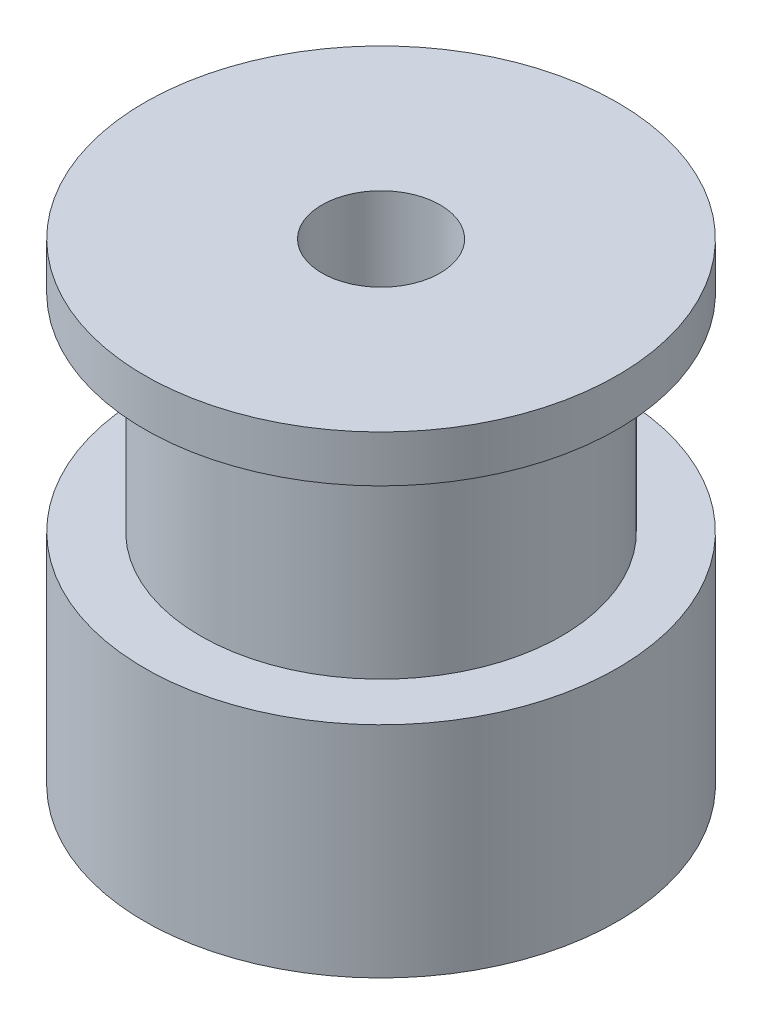
ISO-10303-21;
HEADER;
FILE_DESCRIPTION(('STEP AP214'),'2;1');
FILE_NAME('part.step','',(''),(''),'','','');
FILE_SCHEMA(('AUTOMOTIVE_DESIGN { 1 0 10303 214 1 1 1 1 }'));
ENDSEC;
DATA;
#1=APPLICATION_CONTEXT('core data for automotive mechanical design processes');
#2=APPLICATION_PROTOCOL_DEFINITION('international standard','automotive_design',2000,#1);
#3=PRODUCT_CONTEXT('',#1,'mechanical');
#4=PRODUCT('Part','Part','',(#3));
#5=PRODUCT_RELATED_PRODUCT_CATEGORY('part','',(#4));
#6=PRODUCT_DEFINITION_FORMATION('','',#4);
#7=PRODUCT_DEFINITION_CONTEXT('part definition',#1,'design');
#8=PRODUCT_DEFINITION('design','',#6,#7);
#9=PRODUCT_DEFINITION_SHAPE('','',#8);
#10=(LENGTH_UNIT() NAMED_UNIT(*) SI_UNIT(.MILLI.,.METRE.));
#11=(NAMED_UNIT(*) PLANE_ANGLE_UNIT() SI_UNIT($,.RADIAN.));
#12=(NAMED_UNIT(*) SI_UNIT($,.STERADIAN.) SOLID_ANGLE_UNIT());
#13=UNCERTAINTY_MEASURE_WITH_UNIT(LENGTH_MEASURE(1.E-05),#10,'distance_accuracy_value','');
#14=(GEOMETRIC_REPRESENTATION_CONTEXT(3) GLOBAL_UNCERTAINTY_ASSIGNED_CONTEXT((#13)) GLOBAL_UNIT_ASSIGNED_CONTEXT((#10,
#11,#12)) REPRESENTATION_CONTEXT('',''));
#15=CARTESIAN_POINT('',(0.,0.,0.));
#16=DIRECTION('',(0.,0.,1.));
#17=DIRECTION('',(1.,0.,0.));
#18=AXIS2_PLACEMENT_3D('',#15,#16,#17);
#19=CARTESIAN_POINT('',(0.,0.,0.));
#20=DIRECTION('',(0.,-1.,0.));
#21=DIRECTION('',(0.,0.,-1.));
#22=AXIS2_PLACEMENT_3D('',#19,#20,#21);
#23=CYLINDRICAL_SURFACE('',#22,8.);
#24=CARTESIAN_POINT('',(0.,0.,0.));
#25=DIRECTION('',(0.,-1.,0.));
#26=DIRECTION('',(0.,0.,-1.));
#27=AXIS2_PLACEMENT_3D('',#24,#25,#26);
#28=CIRCLE('',#27,8.);
#29=CARTESIAN_POINT('',(0.,0.,-8.));
#30=VERTEX_POINT('',#29);
#31=EDGE_CURVE('E72',#30,#30,#28,.T.);
#32=ORIENTED_EDGE('',*,*,#31,.F.);
#33=EDGE_LOOP('',(#32));
#34=FACE_BOUND('',#33,.T.);
#35=CARTESIAN_POINT('',(0.,7.42,0.));
#36=DIRECTION('',(0.,-1.,0.));
#37=DIRECTION('',(0.,0.,-1.));
#38=AXIS2_PLACEMENT_3D('',#35,#36,#37);
#39=CIRCLE('',#38,8.);
#40=CARTESIAN_POINT('',(0.,7.42,-8.));
#41=VERTEX_POINT('',#40);
#42=EDGE_CURVE('E10',#41,#41,#39,.T.);
#43=ORIENTED_EDGE('',*,*,#42,.T.);
#44=EDGE_LOOP('',(#43));
#45=FACE_BOUND('',#44,.T.);
#46=ADVANCED_FACE('F37',(#34,#45),#23,.T.);
#47=CARTESIAN_POINT('',(-8.,7.42,0.));
#48=DIRECTION('',(0.,-1.,0.));
#49=DIRECTION('',(0.,0.,-1.));
#50=AXIS2_PLACEMENT_3D('',#47,#48,#49);
#51=PLANE('',#50);
#52=ORIENTED_EDGE('',*,*,#42,.F.);
#53=EDGE_LOOP('',(#52));
#54=FACE_BOUND('',#53,.T.);
#55=CARTESIAN_POINT('',(0.,7.42,0.));
#56=DIRECTION('',(0.,-1.,0.));
#57=DIRECTION('',(0.,0.,-1.));
#58=AXIS2_PLACEMENT_3D('',#55,#56,#57);
#59=CIRCLE('',#58,6.11);
#60=CARTESIAN_POINT('',(0.,7.42,-6.11));
#61=VERTEX_POINT('',#60);
#62=EDGE_CURVE('E44',#61,#61,#59,.T.);
#63=ORIENTED_EDGE('',*,*,#62,.T.);
#64=EDGE_LOOP('',(#63));
#65=FACE_BOUND('',#64,.T.);
#66=ADVANCED_FACE('F80',(#54,#65),#51,.F.);
#67=CARTESIAN_POINT('',(0.,0.,0.));
#68=DIRECTION('',(0.,-1.,0.));
#69=DIRECTION('',(0.,0.,-1.));
#70=AXIS2_PLACEMENT_3D('',#67,#68,#69);
#71=CYLINDRICAL_SURFACE('',#70,6.11);
#72=ORIENTED_EDGE('',*,*,#62,.F.);
#73=EDGE_LOOP('',(#72));
#74=FACE_BOUND('',#73,.T.);
#75=CARTESIAN_POINT('',(0.,14.42,0.));
#76=DIRECTION('',(0.,-1.,0.));
#77=DIRECTION('',(0.,0.,-1.));
#78=AXIS2_PLACEMENT_3D('',#75,#76,#77);
#79=CIRCLE('',#78,6.11);
#80=CARTESIAN_POINT('',(0.,14.42,-6.11));
#81=VERTEX_POINT('',#80);
#82=EDGE_CURVE('E49',#81,#81,#79,.T.);
#83=ORIENTED_EDGE('',*,*,#82,.T.);
#84=EDGE_LOOP('',(#83));
#85=FACE_BOUND('',#84,.T.);
#86=ADVANCED_FACE('F84',(#74,#85),#71,.T.);
#87=CARTESIAN_POINT('',(-6.11,14.42,0.));
#88=DIRECTION('',(0.,1.,0.));
#89=DIRECTION('',(0.,0.,1.));
#90=AXIS2_PLACEMENT_3D('',#87,#88,#89);
#91=PLANE('',#90);
#92=ORIENTED_EDGE('',*,*,#82,.F.);
#93=EDGE_LOOP('',(#92));
#94=FACE_BOUND('',#93,.T.);
#95=CARTESIAN_POINT('',(0.,14.42,0.));
#96=DIRECTION('',(0.,-1.,0.));
#97=DIRECTION('',(0.,0.,-1.));
#98=AXIS2_PLACEMENT_3D('',#95,#96,#97);
#99=CIRCLE('',#98,8.);
#100=CARTESIAN_POINT('',(0.,14.42,-8.));
#101=VERTEX_POINT('',#100);
#102=EDGE_CURVE('E54',#101,#101,#99,.T.);
#103=ORIENTED_EDGE('',*,*,#102,.T.);
#104=EDGE_LOOP('',(#103));
#105=FACE_BOUND('',#104,.T.);
#106=ADVANCED_FACE('F89',(#94,#105),#91,.F.);
#107=CARTESIAN_POINT('',(0.,0.,0.));
#108=DIRECTION('',(0.,-1.,0.));
#109=DIRECTION('',(0.,0.,-1.));
#110=AXIS2_PLACEMENT_3D('',#107,#108,#109);
#111=CYLINDRICAL_SURFACE('',#110,8.);
#112=ORIENTED_EDGE('',*,*,#102,.F.);
#113=EDGE_LOOP('',(#112));
#114=FACE_BOUND('',#113,.T.);
#115=CARTESIAN_POINT('',(0.,16.,0.));
#116=DIRECTION('',(0.,-1.,0.));
#117=DIRECTION('',(0.,0.,-1.));
#118=AXIS2_PLACEMENT_3D('',#115,#116,#117);
#119=CIRCLE('',#118,8.);
#120=CARTESIAN_POINT('',(0.,16.,-8.));
#121=VERTEX_POINT('',#120);
#122=EDGE_CURVE('E60',#121,#121,#119,.T.);
#123=ORIENTED_EDGE('',*,*,#122,.T.);
#124=EDGE_LOOP('',(#123));
#125=FACE_BOUND('',#124,.T.);
#126=ADVANCED_FACE('F95',(#114,#125),#111,.T.);
#127=CARTESIAN_POINT('',(-8.,16.,0.));
#128=DIRECTION('',(0.,-1.,0.));
#129=DIRECTION('',(0.,0.,-1.));
#130=AXIS2_PLACEMENT_3D('',#127,#128,#129);
#131=PLANE('',#130);
#132=ORIENTED_EDGE('',*,*,#122,.F.);
#133=EDGE_LOOP('',(#132));
#134=FACE_BOUND('',#133,.T.);
#135=CARTESIAN_POINT('',(0.,16.,0.));
#136=DIRECTION('',(0.,-1.,0.));
#137=DIRECTION('',(0.,0.,-1.));
#138=AXIS2_PLACEMENT_3D('',#135,#136,#137);
#139=CIRCLE('',#138,2.);
#140=CARTESIAN_POINT('',(0.,16.,-2.));
#141=VERTEX_POINT('',#140);
#142=EDGE_CURVE('E64',#141,#141,#139,.T.);
#143=ORIENTED_EDGE('',*,*,#142,.T.);
#144=EDGE_LOOP('',(#143));
#145=FACE_BOUND('',#144,.T.);
#146=ADVANCED_FACE('F99',(#134,#145),#131,.F.);
#147=CARTESIAN_POINT('',(0.,0.,0.));
#148=DIRECTION('',(0.,-1.,0.));
#149=DIRECTION('',(0.,0.,-1.));
#150=AXIS2_PLACEMENT_3D('',#147,#148,#149);
#151=CYLINDRICAL_SURFACE('',#150,2.);
#152=ORIENTED_EDGE('',*,*,#142,.F.);
#153=EDGE_LOOP('',(#152));
#154=FACE_BOUND('',#153,.T.);
#155=CARTESIAN_POINT('',(0.,0.,0.));
#156=DIRECTION('',(0.,-1.,0.));
#157=DIRECTION('',(0.,0.,-1.));
#158=AXIS2_PLACEMENT_3D('',#155,#156,#157);
#159=CIRCLE('',#158,2.);
#160=CARTESIAN_POINT('',(0.,0.,-2.));
#161=VERTEX_POINT('',#160);
#162=EDGE_CURVE('E68',#161,#161,#159,.T.);
#163=ORIENTED_EDGE('',*,*,#162,.T.);
#164=EDGE_LOOP('',(#163));
#165=FACE_BOUND('',#164,.T.);
#166=ADVANCED_FACE('F103',(#154,#165),#151,.F.);
#167=CARTESIAN_POINT('',(-2.,0.,0.));
#168=DIRECTION('',(0.,1.,0.));
#169=DIRECTION('',(0.,0.,1.));
#170=AXIS2_PLACEMENT_3D('',#167,#168,#169);
#171=PLANE('',#170);
#172=ORIENTED_EDGE('',*,*,#162,.F.);
#173=EDGE_LOOP('',(#172));
#174=FACE_BOUND('',#173,.T.);
#175=ORIENTED_EDGE('',*,*,#31,.T.);
#176=EDGE_LOOP('',(#175));
#177=FACE_BOUND('',#176,.T.);
#178=ADVANCED_FACE('F77',(#174,#177),#171,.F.);
#179=CLOSED_SHELL('',(#46,#66,#86,#106,#126,#146,#166,#178));
#180=MANIFOLD_SOLID_BREP('B2',#179);
#181=ADVANCED_BREP_SHAPE_REPRESENTATION('',(#18,#180),#14);
#182=SHAPE_DEFINITION_REPRESENTATION(#9,#181);
ENDSEC;
END-ISO-10303-21;
